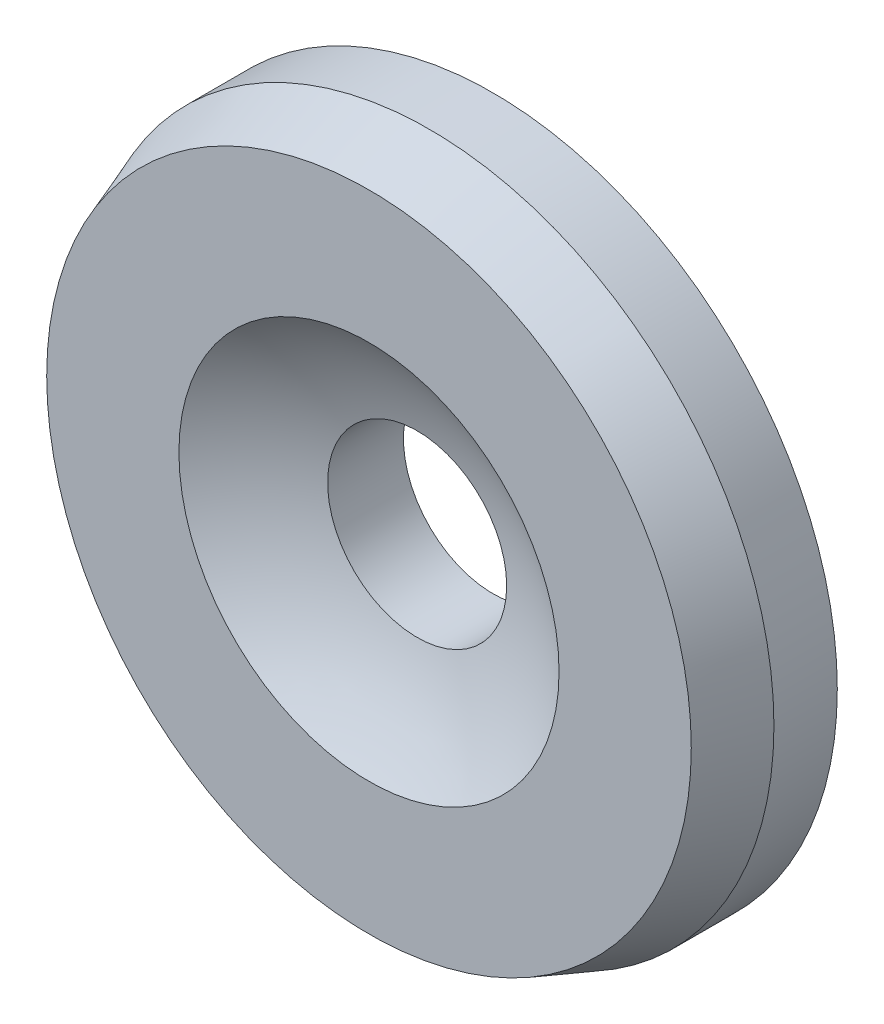
ISO-10303-21;
HEADER;
FILE_DESCRIPTION(('STEP AP214'),'2;1');
FILE_NAME('part.step','',(''),(''),'','','');
FILE_SCHEMA(('AUTOMOTIVE_DESIGN { 1 0 10303 214 1 1 1 1 }'));
ENDSEC;
DATA;
#1=APPLICATION_CONTEXT('core data for automotive mechanical design processes');
#2=APPLICATION_PROTOCOL_DEFINITION('international standard','automotive_design',2000,#1);
#3=PRODUCT_CONTEXT('',#1,'mechanical');
#4=PRODUCT('Part','Part','',(#3));
#5=PRODUCT_RELATED_PRODUCT_CATEGORY('part','',(#4));
#6=PRODUCT_DEFINITION_FORMATION('','',#4);
#7=PRODUCT_DEFINITION_CONTEXT('part definition',#1,'design');
#8=PRODUCT_DEFINITION('design','',#6,#7);
#9=PRODUCT_DEFINITION_SHAPE('','',#8);
#10=(LENGTH_UNIT() NAMED_UNIT(*) SI_UNIT(.MILLI.,.METRE.));
#11=(NAMED_UNIT(*) PLANE_ANGLE_UNIT() SI_UNIT($,.RADIAN.));
#12=(NAMED_UNIT(*) SI_UNIT($,.STERADIAN.) SOLID_ANGLE_UNIT());
#13=UNCERTAINTY_MEASURE_WITH_UNIT(LENGTH_MEASURE(1.E-05),#10,'distance_accuracy_value','');
#14=(GEOMETRIC_REPRESENTATION_CONTEXT(3) GLOBAL_UNCERTAINTY_ASSIGNED_CONTEXT((#13)) GLOBAL_UNIT_ASSIGNED_CONTEXT((#10,
#11,#12)) REPRESENTATION_CONTEXT('',''));
#15=CARTESIAN_POINT('',(0.,0.,0.));
#16=DIRECTION('',(0.,0.,1.));
#17=DIRECTION('',(1.,0.,0.));
#18=AXIS2_PLACEMENT_3D('',#15,#16,#17);
#19=CARTESIAN_POINT('',(0.,0.,1.77));
#20=DIRECTION('',(0.,0.,-1.));
#21=DIRECTION('',(-1.,0.,0.));
#22=AXIS2_PLACEMENT_3D('',#19,#20,#21);
#23=CONICAL_SURFACE('',#22,1.16992654846144,0.349065850398867);
#24=CARTESIAN_POINT('',(0.,0.,1.55));
#25=DIRECTION('',(0.,0.,1.));
#26=DIRECTION('',(1.,0.,0.));
#27=AXIS2_PLACEMENT_3D('',#24,#25,#26);
#28=CIRCLE('',#27,1.25);
#29=CARTESIAN_POINT('',(1.25,0.,1.55));
#30=VERTEX_POINT('',#29);
#31=EDGE_CURVE('E52',#30,#30,#28,.T.);
#32=ORIENTED_EDGE('',*,*,#31,.T.);
#33=EDGE_LOOP('',(#32));
#34=FACE_BOUND('',#33,.T.);
#35=CARTESIAN_POINT('',(0.,0.,1.77));
#36=DIRECTION('',(0.,0.,1.));
#37=DIRECTION('',(1.,0.,0.));
#38=AXIS2_PLACEMENT_3D('',#35,#36,#37);
#39=CIRCLE('',#38,1.16992654846144);
#40=CARTESIAN_POINT('',(1.16992654846144,0.,1.77));
#41=VERTEX_POINT('',#40);
#42=EDGE_CURVE('E10',#41,#41,#39,.T.);
#43=ORIENTED_EDGE('',*,*,#42,.F.);
#44=EDGE_LOOP('',(#43));
#45=FACE_BOUND('',#44,.T.);
#46=ADVANCED_FACE('F30',(#34,#45),#23,.T.);
#47=CARTESIAN_POINT('',(0.69,0.,1.77));
#48=DIRECTION('',(0.,0.,1.));
#49=DIRECTION('',(1.,0.,0.));
#50=AXIS2_PLACEMENT_3D('',#47,#48,#49);
#51=PLANE('',#50);
#52=ORIENTED_EDGE('',*,*,#42,.T.);
#53=EDGE_LOOP('',(#52));
#54=FACE_BOUND('',#53,.T.);
#55=CARTESIAN_POINT('',(0.,0.,1.77));
#56=DIRECTION('',(0.,0.,1.));
#57=DIRECTION('',(1.,0.,0.));
#58=AXIS2_PLACEMENT_3D('',#55,#56,#57);
#59=CIRCLE('',#58,0.69);
#60=CARTESIAN_POINT('',(0.69,0.,1.77));
#61=VERTEX_POINT('',#60);
#62=EDGE_CURVE('E36',#61,#61,#59,.T.);
#63=ORIENTED_EDGE('',*,*,#62,.F.);
#64=EDGE_LOOP('',(#63));
#65=FACE_BOUND('',#64,.T.);
#66=ADVANCED_FACE('F70',(#54,#65),#51,.T.);
#67=CARTESIAN_POINT('',(0.,0.,2.74204545454545));
#68=DIRECTION('',(0.,0.,1.));
#69=DIRECTION('',(1.,0.,0.));
#70=AXIS2_PLACEMENT_3D('',#67,#68,#69);
#71=SPHERICAL_SURFACE('',#70,1.19204545454545);
#72=ORIENTED_EDGE('',*,*,#62,.T.);
#73=EDGE_LOOP('',(#72));
#74=FACE_BOUND('',#73,.T.);
#75=CARTESIAN_POINT('',(0.,0.,1.59515951178459));
#76=DIRECTION('',(0.,0.,1.));
#77=DIRECTION('',(1.,0.,0.));
#78=AXIS2_PLACEMENT_3D('',#75,#76,#77);
#79=CIRCLE('',#78,0.325);
#80=CARTESIAN_POINT('',(0.325,0.,1.59515951178459));
#81=VERTEX_POINT('',#80);
#82=EDGE_CURVE('E40',#81,#81,#79,.T.);
#83=ORIENTED_EDGE('',*,*,#82,.F.);
#84=EDGE_LOOP('',(#83));
#85=FACE_BOUND('',#84,.T.);
#86=ADVANCED_FACE('F74',(#74,#85),#71,.F.);
#87=CARTESIAN_POINT('',(0.,0.,1.32));
#88=DIRECTION('',(0.,0.,1.));
#89=DIRECTION('',(1.,0.,0.));
#90=AXIS2_PLACEMENT_3D('',#87,#88,#89);
#91=CYLINDRICAL_SURFACE('',#90,0.325);
#92=ORIENTED_EDGE('',*,*,#82,.T.);
#93=EDGE_LOOP('',(#92));
#94=FACE_BOUND('',#93,.T.);
#95=CARTESIAN_POINT('',(0.,0.,1.32));
#96=DIRECTION('',(0.,0.,1.));
#97=DIRECTION('',(1.,0.,0.));
#98=AXIS2_PLACEMENT_3D('',#95,#96,#97);
#99=CIRCLE('',#98,0.325);
#100=CARTESIAN_POINT('',(0.325,0.,1.32));
#101=VERTEX_POINT('',#100);
#102=EDGE_CURVE('E44',#101,#101,#99,.T.);
#103=ORIENTED_EDGE('',*,*,#102,.F.);
#104=EDGE_LOOP('',(#103));
#105=FACE_BOUND('',#104,.T.);
#106=ADVANCED_FACE('F66',(#94,#105),#91,.F.);
#107=CARTESIAN_POINT('',(1.25,0.,1.32));
#108=DIRECTION('',(0.,0.,-1.));
#109=DIRECTION('',(-1.,0.,0.));
#110=AXIS2_PLACEMENT_3D('',#107,#108,#109);
#111=PLANE('',#110);
#112=ORIENTED_EDGE('',*,*,#102,.T.);
#113=EDGE_LOOP('',(#112));
#114=FACE_BOUND('',#113,.T.);
#115=CARTESIAN_POINT('',(0.,0.,1.32));
#116=DIRECTION('',(0.,0.,1.));
#117=DIRECTION('',(1.,0.,0.));
#118=AXIS2_PLACEMENT_3D('',#115,#116,#117);
#119=CIRCLE('',#118,1.25);
#120=CARTESIAN_POINT('',(1.25,0.,1.32));
#121=VERTEX_POINT('',#120);
#122=EDGE_CURVE('E49',#121,#121,#119,.T.);
#123=ORIENTED_EDGE('',*,*,#122,.F.);
#124=EDGE_LOOP('',(#123));
#125=FACE_BOUND('',#124,.T.);
#126=ADVANCED_FACE('F60',(#114,#125),#111,.T.);
#127=CARTESIAN_POINT('',(0.,0.,1.32));
#128=DIRECTION('',(0.,0.,1.));
#129=DIRECTION('',(1.,0.,0.));
#130=AXIS2_PLACEMENT_3D('',#127,#128,#129);
#131=CYLINDRICAL_SURFACE('',#130,1.25);
#132=ORIENTED_EDGE('',*,*,#122,.T.);
#133=EDGE_LOOP('',(#132));
#134=FACE_BOUND('',#133,.T.);
#135=ORIENTED_EDGE('',*,*,#31,.F.);
#136=EDGE_LOOP('',(#135));
#137=FACE_BOUND('',#136,.T.);
#138=ADVANCED_FACE('F58',(#134,#137),#131,.T.);
#139=CLOSED_SHELL('',(#46,#66,#86,#106,#126,#138));
#140=MANIFOLD_SOLID_BREP('B2',#139);
#141=ADVANCED_BREP_SHAPE_REPRESENTATION('',(#18,#140),#14);
#142=SHAPE_DEFINITION_REPRESENTATION(#9,#141);
ENDSEC;
END-ISO-10303-21;
